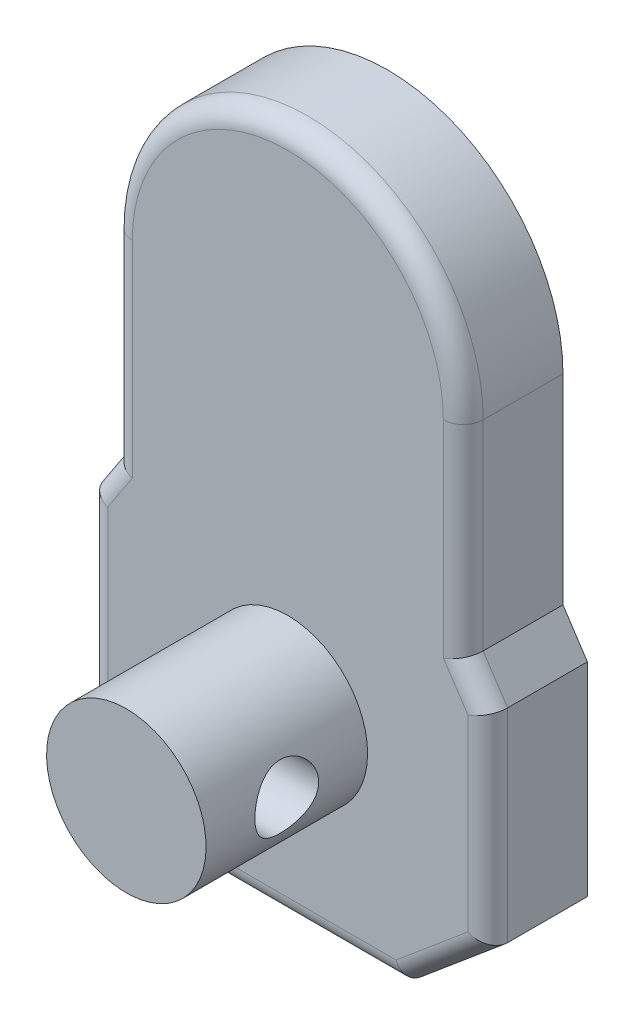
ISO-10303-21;
HEADER;
FILE_DESCRIPTION(('STEP AP214'),'2;1');
FILE_NAME('part.step','',(''),(''),'','','');
FILE_SCHEMA(('AUTOMOTIVE_DESIGN { 1 0 10303 214 1 1 1 1 }'));
ENDSEC;
DATA;
#1=APPLICATION_CONTEXT('core data for automotive mechanical design processes');
#2=APPLICATION_PROTOCOL_DEFINITION('international standard','automotive_design',2000,#1);
#3=PRODUCT_CONTEXT('',#1,'mechanical');
#4=PRODUCT('Part','Part','',(#3));
#5=PRODUCT_RELATED_PRODUCT_CATEGORY('part','',(#4));
#6=PRODUCT_DEFINITION_FORMATION('','',#4);
#7=PRODUCT_DEFINITION_CONTEXT('part definition',#1,'design');
#8=PRODUCT_DEFINITION('design','',#6,#7);
#9=PRODUCT_DEFINITION_SHAPE('','',#8);
#10=(LENGTH_UNIT() NAMED_UNIT(*) SI_UNIT(.MILLI.,.METRE.));
#11=(NAMED_UNIT(*) PLANE_ANGLE_UNIT() SI_UNIT($,.RADIAN.));
#12=(NAMED_UNIT(*) SI_UNIT($,.STERADIAN.) SOLID_ANGLE_UNIT());
#13=UNCERTAINTY_MEASURE_WITH_UNIT(LENGTH_MEASURE(1.E-05),#10,'distance_accuracy_value','');
#14=(GEOMETRIC_REPRESENTATION_CONTEXT(3) GLOBAL_UNCERTAINTY_ASSIGNED_CONTEXT((#13)) GLOBAL_UNIT_ASSIGNED_CONTEXT((#10,
#11,#12)) REPRESENTATION_CONTEXT('',''));
#15=CARTESIAN_POINT('',(0.,0.,0.));
#16=DIRECTION('',(0.,0.,1.));
#17=DIRECTION('',(1.,0.,0.));
#18=AXIS2_PLACEMENT_3D('',#15,#16,#17);
#19=CARTESIAN_POINT('',(0.,32.8,130.3));
#20=DIRECTION('',(0.,0.,1.));
#21=DIRECTION('',(1.,0.,0.));
#22=AXIS2_PLACEMENT_3D('',#19,#20,#21);
#23=PLANE('',#22);
#24=CARTESIAN_POINT('',(-16.,9.,130.3));
#25=DIRECTION('',(0.,0.,1.));
#26=DIRECTION('',(1.,0.,0.));
#27=AXIS2_PLACEMENT_3D('',#24,#25,#26);
#28=CIRCLE('',#27,2.4);
#29=CARTESIAN_POINT('',(-13.6,9.,130.3));
#30=VERTEX_POINT('',#29);
#31=EDGE_CURVE('E678',#30,#30,#28,.T.);
#32=ORIENTED_EDGE('',*,*,#31,.T.);
#33=EDGE_LOOP('',(#32));
#34=FACE_BOUND('',#33,.T.);
#35=CARTESIAN_POINT('',(16.,-9.,130.3));
#36=DIRECTION('',(0.,0.,1.));
#37=DIRECTION('',(1.,0.,0.));
#38=AXIS2_PLACEMENT_3D('',#35,#36,#37);
#39=CIRCLE('',#38,2.4);
#40=CARTESIAN_POINT('',(18.4,-9.,130.3));
#41=VERTEX_POINT('',#40);
#42=EDGE_CURVE('E689',#41,#41,#39,.T.);
#43=ORIENTED_EDGE('',*,*,#42,.T.);
#44=EDGE_LOOP('',(#43));
#45=FACE_BOUND('',#44,.T.);
#46=CARTESIAN_POINT('',(0.,32.8,130.3));
#47=DIRECTION('',(0.,0.,1.));
#48=DIRECTION('',(1.,0.,0.));
#49=AXIS2_PLACEMENT_3D('',#46,#47,#48);
#50=CIRCLE('',#49,17.6);
#51=CARTESIAN_POINT('',(17.6,32.8,130.3));
#52=VERTEX_POINT('',#51);
#53=CARTESIAN_POINT('',(-17.6,32.8,130.3));
#54=VERTEX_POINT('',#53);
#55=EDGE_CURVE('E159',#52,#54,#50,.T.);
#56=ORIENTED_EDGE('',*,*,#55,.F.);
#57=DIRECTION('',(0.,1.,0.));
#58=VECTOR('',#57,1.);
#59=CARTESIAN_POINT('',(17.6,12.7205510344571,130.3));
#60=LINE('',#59,#58);
#61=CARTESIAN_POINT('',(17.6,12.7205510344571,130.3));
#62=VERTEX_POINT('',#61);
#63=EDGE_CURVE('E194',#62,#52,#60,.T.);
#64=ORIENTED_EDGE('',*,*,#63,.F.);
#65=DIRECTION('',(-0.54997194092287,0.835183132131829,0.));
#66=VECTOR('',#65,1.);
#67=CARTESIAN_POINT('',(20.05,9.,130.3));
#68=LINE('',#67,#66);
#69=CARTESIAN_POINT('',(20.05,9.,130.3));
#70=VERTEX_POINT('',#69);
#71=EDGE_CURVE('E191',#70,#62,#68,.T.);
#72=ORIENTED_EDGE('',*,*,#71,.F.);
#73=DIRECTION('',(0.,1.,0.));
#74=VECTOR('',#73,1.);
#75=CARTESIAN_POINT('',(20.05,0.,130.3));
#76=LINE('',#75,#74);
#77=CARTESIAN_POINT('',(20.05,-11.4,130.3));
#78=VERTEX_POINT('',#77);
#79=EDGE_CURVE('E188',#78,#70,#76,.T.);
#80=ORIENTED_EDGE('',*,*,#79,.F.);
#81=DIRECTION('',(0.76604444311898,0.642787609686537,0.));
#82=VECTOR('',#81,1.);
#83=CARTESIAN_POINT('',(20.05,-11.4,130.3));
#84=LINE('',#83,#82);
#85=CARTESIAN_POINT('',(11.5885494925811,-18.5,130.3));
#86=VERTEX_POINT('',#85);
#87=EDGE_CURVE('E185',#86,#78,#84,.T.);
#88=ORIENTED_EDGE('',*,*,#87,.F.);
#89=DIRECTION('',(1.,0.,0.));
#90=VECTOR('',#89,1.);
#91=CARTESIAN_POINT('',(11.5885494925811,-18.5,130.3));
#92=LINE('',#91,#90);
#93=CARTESIAN_POINT('',(-11.5885494925811,-18.5,130.3));
#94=VERTEX_POINT('',#93);
#95=EDGE_CURVE('E182',#94,#86,#92,.T.);
#96=ORIENTED_EDGE('',*,*,#95,.F.);
#97=DIRECTION('',(0.76604444311898,-0.642787609686537,0.));
#98=VECTOR('',#97,1.);
#99=CARTESIAN_POINT('',(-20.05,-11.4,130.3));
#100=LINE('',#99,#98);
#101=CARTESIAN_POINT('',(-20.05,-11.4,130.3));
#102=VERTEX_POINT('',#101);
#103=EDGE_CURVE('E179',#102,#94,#100,.T.);
#104=ORIENTED_EDGE('',*,*,#103,.F.);
#105=DIRECTION('',(0.,-1.,0.));
#106=VECTOR('',#105,1.);
#107=CARTESIAN_POINT('',(-20.05,0.,130.3));
#108=LINE('',#107,#106);
#109=CARTESIAN_POINT('',(-20.05,9.,130.3));
#110=VERTEX_POINT('',#109);
#111=EDGE_CURVE('E173',#110,#102,#108,.T.);
#112=ORIENTED_EDGE('',*,*,#111,.F.);
#113=DIRECTION('',(-0.54997194092287,-0.835183132131829,0.));
#114=VECTOR('',#113,1.);
#115=CARTESIAN_POINT('',(-20.05,9.,130.3));
#116=LINE('',#115,#114);
#117=CARTESIAN_POINT('',(-17.6,12.7205510344571,130.3));
#118=VERTEX_POINT('',#117);
#119=EDGE_CURVE('E171',#118,#110,#116,.T.);
#120=ORIENTED_EDGE('',*,*,#119,.F.);
#121=DIRECTION('',(0.,-1.,0.));
#122=VECTOR('',#121,1.);
#123=CARTESIAN_POINT('',(-17.6,12.7205510344571,130.3));
#124=LINE('',#123,#122);
#125=EDGE_CURVE('E149',#54,#118,#124,.T.);
#126=ORIENTED_EDGE('',*,*,#125,.F.);
#127=EDGE_LOOP('',(#56,#64,#72,#80,#88,#96,#104,#112,#120,#126));
#128=FACE_BOUND('',#127,.T.);
#129=CARTESIAN_POINT('',(-16.,-9.,130.3));
#130=DIRECTION('',(0.,0.,1.));
#131=DIRECTION('',(1.,0.,0.));
#132=AXIS2_PLACEMENT_3D('',#129,#130,#131);
#133=CIRCLE('',#132,2.4);
#134=CARTESIAN_POINT('',(-13.6,-9.,130.3));
#135=VERTEX_POINT('',#134);
#136=EDGE_CURVE('E684',#135,#135,#133,.T.);
#137=ORIENTED_EDGE('',*,*,#136,.T.);
#138=EDGE_LOOP('',(#137));
#139=FACE_BOUND('',#138,.T.);
#140=CARTESIAN_POINT('',(16.,9.,130.3));
#141=DIRECTION('',(0.,0.,1.));
#142=DIRECTION('',(1.,0.,0.));
#143=AXIS2_PLACEMENT_3D('',#140,#141,#142);
#144=CIRCLE('',#143,2.4);
#145=CARTESIAN_POINT('',(18.4,9.,130.3));
#146=VERTEX_POINT('',#145);
#147=EDGE_CURVE('E339',#146,#146,#144,.T.);
#148=ORIENTED_EDGE('',*,*,#147,.T.);
#149=EDGE_LOOP('',(#148));
#150=FACE_BOUND('',#149,.T.);
#151=ADVANCED_FACE('F36',(#34,#45,#128,#139,#150),#23,.F.);
#152=CARTESIAN_POINT('',(0.,32.8,140.3));
#153=DIRECTION('',(0.,0.,-1.));
#154=DIRECTION('',(-1.,0.,0.));
#155=AXIS2_PLACEMENT_3D('',#152,#153,#154);
#156=CYLINDRICAL_SURFACE('',#155,17.6);
#157=DIRECTION('',(0.,0.,-1.));
#158=VECTOR('',#157,1.);
#159=CARTESIAN_POINT('',(-17.6,32.8,140.3));
#160=LINE('',#159,#158);
#161=CARTESIAN_POINT('',(-17.6,32.8,138.3));
#162=VERTEX_POINT('',#161);
#163=EDGE_CURVE('E144',#162,#54,#160,.T.);
#164=ORIENTED_EDGE('',*,*,#163,.F.);
#165=CARTESIAN_POINT('',(0.,32.8,138.3));
#166=DIRECTION('',(0.,0.,1.));
#167=DIRECTION('',(1.,0.,0.));
#168=AXIS2_PLACEMENT_3D('',#165,#166,#167);
#169=CIRCLE('',#168,17.6);
#170=CARTESIAN_POINT('',(17.6,32.8,138.3));
#171=VERTEX_POINT('',#170);
#172=EDGE_CURVE('E11',#162,#171,#169,.F.);
#173=ORIENTED_EDGE('',*,*,#172,.T.);
#174=DIRECTION('',(0.,0.,-1.));
#175=VECTOR('',#174,1.);
#176=CARTESIAN_POINT('',(17.6,32.8,140.3));
#177=LINE('',#176,#175);
#178=EDGE_CURVE('E162',#171,#52,#177,.T.);
#179=ORIENTED_EDGE('',*,*,#178,.T.);
#180=ORIENTED_EDGE('',*,*,#55,.T.);
#181=EDGE_LOOP('',(#164,#173,#179,#180));
#182=FACE_BOUND('',#181,.T.);
#183=ADVANCED_FACE('F160',(#182),#156,.T.);
#184=CARTESIAN_POINT('',(-17.6,12.7205510344571,140.3));
#185=DIRECTION('',(1.,0.,0.));
#186=DIRECTION('',(0.,0.,-1.));
#187=AXIS2_PLACEMENT_3D('',#184,#185,#186);
#188=PLANE('',#187);
#189=DIRECTION('',(0.,0.,-1.));
#190=VECTOR('',#189,1.);
#191=CARTESIAN_POINT('',(-17.6,12.7205510344571,140.3));
#192=LINE('',#191,#190);
#193=CARTESIAN_POINT('',(-17.6,12.7205510344571,138.3));
#194=VERTEX_POINT('',#193);
#195=EDGE_CURVE('E156',#194,#118,#192,.T.);
#196=ORIENTED_EDGE('',*,*,#195,.F.);
#197=DIRECTION('',(0.,-1.,0.));
#198=VECTOR('',#197,1.);
#199=CARTESIAN_POINT('',(-17.6,32.8,138.3));
#200=LINE('',#199,#198);
#201=EDGE_CURVE('E152',#194,#162,#200,.F.);
#202=ORIENTED_EDGE('',*,*,#201,.T.);
#203=ORIENTED_EDGE('',*,*,#163,.T.);
#204=ORIENTED_EDGE('',*,*,#125,.T.);
#205=EDGE_LOOP('',(#196,#202,#203,#204));
#206=FACE_BOUND('',#205,.T.);
#207=ADVANCED_FACE('F147',(#206),#188,.F.);
#208=CARTESIAN_POINT('',(-20.05,9.,140.3));
#209=DIRECTION('',(0.835183132131829,-0.54997194092287,0.));
#210=DIRECTION('',(0.54997194092287,0.835183132131829,0.));
#211=AXIS2_PLACEMENT_3D('',#208,#209,#210);
#212=PLANE('',#211);
#213=DIRECTION('',(0.,0.,-1.));
#214=VECTOR('',#213,1.);
#215=CARTESIAN_POINT('',(-20.05,9.,140.3));
#216=LINE('',#215,#214);
#217=CARTESIAN_POINT('',(-20.05,9.,138.3));
#218=VERTEX_POINT('',#217);
#219=EDGE_CURVE('E209',#218,#110,#216,.T.);
#220=ORIENTED_EDGE('',*,*,#219,.F.);
#221=DIRECTION('',(-0.54997194092287,-0.835183132131829,0.));
#222=VECTOR('',#221,1.);
#223=CARTESIAN_POINT('',(-17.6,12.7205510344571,138.3));
#224=LINE('',#223,#222);
#225=EDGE_CURVE('E377',#218,#194,#224,.F.);
#226=ORIENTED_EDGE('',*,*,#225,.T.);
#227=ORIENTED_EDGE('',*,*,#195,.T.);
#228=ORIENTED_EDGE('',*,*,#119,.T.);
#229=EDGE_LOOP('',(#220,#226,#227,#228));
#230=FACE_BOUND('',#229,.T.);
#231=ADVANCED_FACE('F283',(#230),#212,.F.);
#232=CARTESIAN_POINT('',(-20.05,0.,140.3));
#233=DIRECTION('',(1.,0.,0.));
#234=DIRECTION('',(0.,0.,-1.));
#235=AXIS2_PLACEMENT_3D('',#232,#233,#234);
#236=PLANE('',#235);
#237=DIRECTION('',(0.,0.,-1.));
#238=VECTOR('',#237,1.);
#239=CARTESIAN_POINT('',(-20.05,-11.4,140.3));
#240=LINE('',#239,#238);
#241=CARTESIAN_POINT('',(-20.05,-11.4,138.3));
#242=VERTEX_POINT('',#241);
#243=EDGE_CURVE('E207',#242,#102,#240,.T.);
#244=ORIENTED_EDGE('',*,*,#243,.F.);
#245=DIRECTION('',(0.,-1.,0.));
#246=VECTOR('',#245,1.);
#247=CARTESIAN_POINT('',(-20.05,9.,138.3));
#248=LINE('',#247,#246);
#249=EDGE_CURVE('E371',#242,#218,#248,.F.);
#250=ORIENTED_EDGE('',*,*,#249,.T.);
#251=ORIENTED_EDGE('',*,*,#219,.T.);
#252=ORIENTED_EDGE('',*,*,#111,.T.);
#253=EDGE_LOOP('',(#244,#250,#251,#252));
#254=FACE_BOUND('',#253,.T.);
#255=ADVANCED_FACE('F279',(#254),#236,.F.);
#256=CARTESIAN_POINT('',(-20.05,-11.4,140.3));
#257=DIRECTION('',(0.642787609686537,0.76604444311898,0.));
#258=DIRECTION('',(-0.76604444311898,0.642787609686537,0.));
#259=AXIS2_PLACEMENT_3D('',#256,#257,#258);
#260=PLANE('',#259);
#261=DIRECTION('',(0.,0.,-1.));
#262=VECTOR('',#261,1.);
#263=CARTESIAN_POINT('',(-11.5885494925811,-18.5,140.3));
#264=LINE('',#263,#262);
#265=CARTESIAN_POINT('',(-11.5885494925811,-18.5,138.3));
#266=VERTEX_POINT('',#265);
#267=EDGE_CURVE('E205',#266,#94,#264,.T.);
#268=ORIENTED_EDGE('',*,*,#267,.F.);
#269=DIRECTION('',(0.76604444311898,-0.642787609686537,0.));
#270=VECTOR('',#269,1.);
#271=CARTESIAN_POINT('',(-20.05,-11.4,138.3));
#272=LINE('',#271,#270);
#273=EDGE_CURVE('E375',#266,#242,#272,.F.);
#274=ORIENTED_EDGE('',*,*,#273,.T.);
#275=ORIENTED_EDGE('',*,*,#243,.T.);
#276=ORIENTED_EDGE('',*,*,#103,.T.);
#277=EDGE_LOOP('',(#268,#274,#275,#276));
#278=FACE_BOUND('',#277,.T.);
#279=ADVANCED_FACE('F275',(#278),#260,.F.);
#280=CARTESIAN_POINT('',(11.5885494925811,-18.5,140.3));
#281=DIRECTION('',(0.,1.,0.));
#282=DIRECTION('',(0.,0.,1.));
#283=AXIS2_PLACEMENT_3D('',#280,#281,#282);
#284=PLANE('',#283);
#285=DIRECTION('',(0.,0.,-1.));
#286=VECTOR('',#285,1.);
#287=CARTESIAN_POINT('',(11.5885494925811,-18.5,140.3));
#288=LINE('',#287,#286);
#289=CARTESIAN_POINT('',(11.5885494925811,-18.5,138.3));
#290=VERTEX_POINT('',#289);
#291=EDGE_CURVE('E203',#290,#86,#288,.T.);
#292=ORIENTED_EDGE('',*,*,#291,.F.);
#293=DIRECTION('',(1.,0.,0.));
#294=VECTOR('',#293,1.);
#295=CARTESIAN_POINT('',(-11.5885494925811,-18.5,138.3));
#296=LINE('',#295,#294);
#297=EDGE_CURVE('E334',#290,#266,#296,.F.);
#298=ORIENTED_EDGE('',*,*,#297,.T.);
#299=ORIENTED_EDGE('',*,*,#267,.T.);
#300=ORIENTED_EDGE('',*,*,#95,.T.);
#301=EDGE_LOOP('',(#292,#298,#299,#300));
#302=FACE_BOUND('',#301,.T.);
#303=ADVANCED_FACE('F272',(#302),#284,.F.);
#304=CARTESIAN_POINT('',(20.05,-11.4,140.3));
#305=DIRECTION('',(-0.642787609686537,0.76604444311898,0.));
#306=DIRECTION('',(-0.76604444311898,-0.642787609686537,0.));
#307=AXIS2_PLACEMENT_3D('',#304,#305,#306);
#308=PLANE('',#307);
#309=DIRECTION('',(0.,0.,-1.));
#310=VECTOR('',#309,1.);
#311=CARTESIAN_POINT('',(20.05,-11.4,140.3));
#312=LINE('',#311,#310);
#313=CARTESIAN_POINT('',(20.05,-11.4,138.3));
#314=VERTEX_POINT('',#313);
#315=EDGE_CURVE('E201',#314,#78,#312,.T.);
#316=ORIENTED_EDGE('',*,*,#315,.F.);
#317=DIRECTION('',(0.76604444311898,0.642787609686537,0.));
#318=VECTOR('',#317,1.);
#319=CARTESIAN_POINT('',(11.5885494925811,-18.5,138.3));
#320=LINE('',#319,#318);
#321=EDGE_CURVE('E53',#314,#290,#320,.F.);
#322=ORIENTED_EDGE('',*,*,#321,.T.);
#323=ORIENTED_EDGE('',*,*,#291,.T.);
#324=ORIENTED_EDGE('',*,*,#87,.T.);
#325=EDGE_LOOP('',(#316,#322,#323,#324));
#326=FACE_BOUND('',#325,.T.);
#327=ADVANCED_FACE('F269',(#326),#308,.F.);
#328=CARTESIAN_POINT('',(20.05,0.,140.3));
#329=DIRECTION('',(-1.,0.,0.));
#330=DIRECTION('',(0.,0.,1.));
#331=AXIS2_PLACEMENT_3D('',#328,#329,#330);
#332=PLANE('',#331);
#333=DIRECTION('',(0.,0.,-1.));
#334=VECTOR('',#333,1.);
#335=CARTESIAN_POINT('',(20.05,9.,140.3));
#336=LINE('',#335,#334);
#337=CARTESIAN_POINT('',(20.05,9.,138.3));
#338=VERTEX_POINT('',#337);
#339=EDGE_CURVE('E199',#338,#70,#336,.T.);
#340=ORIENTED_EDGE('',*,*,#339,.F.);
#341=DIRECTION('',(0.,1.,0.));
#342=VECTOR('',#341,1.);
#343=CARTESIAN_POINT('',(20.05,-11.4,138.3));
#344=LINE('',#343,#342);
#345=EDGE_CURVE('E45',#338,#314,#344,.F.);
#346=ORIENTED_EDGE('',*,*,#345,.T.);
#347=ORIENTED_EDGE('',*,*,#315,.T.);
#348=ORIENTED_EDGE('',*,*,#79,.T.);
#349=EDGE_LOOP('',(#340,#346,#347,#348));
#350=FACE_BOUND('',#349,.T.);
#351=ADVANCED_FACE('F265',(#350),#332,.F.);
#352=CARTESIAN_POINT('',(20.05,9.,140.3));
#353=DIRECTION('',(-0.835183132131829,-0.54997194092287,0.));
#354=DIRECTION('',(0.54997194092287,-0.835183132131829,0.));
#355=AXIS2_PLACEMENT_3D('',#352,#353,#354);
#356=PLANE('',#355);
#357=DIRECTION('',(0.,0.,-1.));
#358=VECTOR('',#357,1.);
#359=CARTESIAN_POINT('',(17.6,12.7205510344571,140.3));
#360=LINE('',#359,#358);
#361=CARTESIAN_POINT('',(17.6,12.7205510344571,138.3));
#362=VERTEX_POINT('',#361);
#363=EDGE_CURVE('E197',#362,#62,#360,.T.);
#364=ORIENTED_EDGE('',*,*,#363,.F.);
#365=DIRECTION('',(-0.54997194092287,0.835183132131829,0.));
#366=VECTOR('',#365,1.);
#367=CARTESIAN_POINT('',(20.05,8.99999999999999,138.3));
#368=LINE('',#367,#366);
#369=EDGE_CURVE('E379',#362,#338,#368,.F.);
#370=ORIENTED_EDGE('',*,*,#369,.T.);
#371=ORIENTED_EDGE('',*,*,#339,.T.);
#372=ORIENTED_EDGE('',*,*,#71,.T.);
#373=EDGE_LOOP('',(#364,#370,#371,#372));
#374=FACE_BOUND('',#373,.T.);
#375=ADVANCED_FACE('F261',(#374),#356,.F.);
#376=CARTESIAN_POINT('',(17.6,12.7205510344571,140.3));
#377=DIRECTION('',(-1.,0.,0.));
#378=DIRECTION('',(0.,0.,1.));
#379=AXIS2_PLACEMENT_3D('',#376,#377,#378);
#380=PLANE('',#379);
#381=ORIENTED_EDGE('',*,*,#178,.F.);
#382=DIRECTION('',(0.,1.,0.));
#383=VECTOR('',#382,1.);
#384=CARTESIAN_POINT('',(17.6,12.7205510344571,138.3));
#385=LINE('',#384,#383);
#386=EDGE_CURVE('E382',#171,#362,#385,.F.);
#387=ORIENTED_EDGE('',*,*,#386,.T.);
#388=ORIENTED_EDGE('',*,*,#363,.T.);
#389=ORIENTED_EDGE('',*,*,#63,.T.);
#390=EDGE_LOOP('',(#381,#387,#388,#389));
#391=FACE_BOUND('',#390,.T.);
#392=ADVANCED_FACE('F258',(#391),#380,.F.);
#393=CARTESIAN_POINT('',(0.,32.8,140.3));
#394=DIRECTION('',(0.,0.,1.));
#395=DIRECTION('',(1.,0.,0.));
#396=AXIS2_PLACEMENT_3D('',#393,#394,#395);
#397=PLANE('',#396);
#398=DIRECTION('',(0.76604444311898,-0.642787609686537,0.));
#399=VECTOR('',#398,1.);
#400=CARTESIAN_POINT('',(-10.302974273208,-16.967911113762,140.3));
#401=LINE('',#400,#399);
#402=CARTESIAN_POINT('',(-18.05,-10.46738468369,140.3));
#403=VERTEX_POINT('',#402);
#404=CARTESIAN_POINT('',(-10.8606090240487,-16.5,140.3));
#405=VERTEX_POINT('',#404);
#406=EDGE_CURVE('E386',#403,#405,#401,.T.);
#407=ORIENTED_EDGE('',*,*,#406,.T.);
#408=DIRECTION('',(1.,0.,0.));
#409=VECTOR('',#408,1.);
#410=CARTESIAN_POINT('',(11.5885494925811,-16.5,140.3));
#411=LINE('',#410,#409);
#412=CARTESIAN_POINT('',(10.8606090240487,-16.5,140.3));
#413=VERTEX_POINT('',#412);
#414=EDGE_CURVE('E336',#405,#413,#411,.T.);
#415=ORIENTED_EDGE('',*,*,#414,.T.);
#416=DIRECTION('',(0.76604444311898,0.642787609686537,0.));
#417=VECTOR('',#416,1.);
#418=CARTESIAN_POINT('',(18.7644247806269,-9.86791111376205,140.3));
#419=LINE('',#418,#417);
#420=CARTESIAN_POINT('',(18.05,-10.46738468369,140.3));
#421=VERTEX_POINT('',#420);
#422=EDGE_CURVE('E388',#413,#421,#419,.T.);
#423=ORIENTED_EDGE('',*,*,#422,.T.);
#424=DIRECTION('',(0.,1.,0.));
#425=VECTOR('',#424,1.);
#426=CARTESIAN_POINT('',(18.05,9.,140.3));
#427=LINE('',#426,#425);
#428=CARTESIAN_POINT('',(18.05,8.40063535753621,140.3));
#429=VERTEX_POINT('',#428);
#430=EDGE_CURVE('E392',#421,#429,#427,.T.);
#431=ORIENTED_EDGE('',*,*,#430,.T.);
#432=DIRECTION('',(-0.54997194092287,0.835183132131829,0.));
#433=VECTOR('',#432,1.);
#434=CARTESIAN_POINT('',(15.9296337357363,11.6206071526114,140.3));
#435=LINE('',#434,#433);
#436=CARTESIAN_POINT('',(15.6,12.1211863919933,140.3));
#437=VERTEX_POINT('',#436);
#438=EDGE_CURVE('E394',#429,#437,#435,.T.);
#439=ORIENTED_EDGE('',*,*,#438,.T.);
#440=DIRECTION('',(0.,1.,0.));
#441=VECTOR('',#440,1.);
#442=CARTESIAN_POINT('',(15.6,32.8,140.3));
#443=LINE('',#442,#441);
#444=CARTESIAN_POINT('',(15.6,32.8,140.3));
#445=VERTEX_POINT('',#444);
#446=EDGE_CURVE('E398',#437,#445,#443,.T.);
#447=ORIENTED_EDGE('',*,*,#446,.T.);
#448=CARTESIAN_POINT('',(0.,32.8,140.3));
#449=DIRECTION('',(0.,0.,1.));
#450=DIRECTION('',(1.,0.,0.));
#451=AXIS2_PLACEMENT_3D('',#448,#449,#450);
#452=CIRCLE('',#451,15.6);
#453=CARTESIAN_POINT('',(-15.6,32.8,140.3));
#454=VERTEX_POINT('',#453);
#455=EDGE_CURVE('E214',#445,#454,#452,.T.);
#456=ORIENTED_EDGE('',*,*,#455,.T.);
#457=DIRECTION('',(0.,-1.,0.));
#458=VECTOR('',#457,1.);
#459=CARTESIAN_POINT('',(-15.6,12.7205510344571,140.3));
#460=LINE('',#459,#458);
#461=CARTESIAN_POINT('',(-15.6,12.1211863919934,140.3));
#462=VERTEX_POINT('',#461);
#463=EDGE_CURVE('E401',#454,#462,#460,.T.);
#464=ORIENTED_EDGE('',*,*,#463,.T.);
#465=DIRECTION('',(-0.54997194092287,-0.835183132131829,0.));
#466=VECTOR('',#465,1.);
#467=CARTESIAN_POINT('',(-18.3796337357363,7.90005611815425,140.3));
#468=LINE('',#467,#466);
#469=CARTESIAN_POINT('',(-18.05,8.40063535753622,140.3));
#470=VERTEX_POINT('',#469);
#471=EDGE_CURVE('E396',#462,#470,#468,.T.);
#472=ORIENTED_EDGE('',*,*,#471,.T.);
#473=DIRECTION('',(0.,-1.,0.));
#474=VECTOR('',#473,1.);
#475=CARTESIAN_POINT('',(-18.05,-11.4,140.3));
#476=LINE('',#475,#474);
#477=EDGE_CURVE('E390',#470,#403,#476,.T.);
#478=ORIENTED_EDGE('',*,*,#477,.T.);
#479=EDGE_LOOP('',(#407,#415,#423,#431,#439,#447,#456,#464,#472,#478));
#480=FACE_BOUND('',#479,.T.);
#481=CARTESIAN_POINT('',(0.,0.,140.3));
#482=DIRECTION('',(0.,0.,1.));
#483=DIRECTION('',(1.,0.,0.));
#484=AXIS2_PLACEMENT_3D('',#481,#482,#483);
#485=CIRCLE('',#484,8.);
#486=CARTESIAN_POINT('',(8.,0.,140.3));
#487=VERTEX_POINT('',#486);
#488=EDGE_CURVE('E155',#487,#487,#485,.T.);
#489=ORIENTED_EDGE('',*,*,#488,.F.);
#490=EDGE_LOOP('',(#489));
#491=FACE_BOUND('',#490,.T.);
#492=ADVANCED_FACE('F245',(#480,#491),#397,.T.);
#493=CARTESIAN_POINT('',(0.,0.,-96.6074446622647));
#494=DIRECTION('',(0.,0.,-1.));
#495=DIRECTION('',(0.,1.,0.));
#496=AXIS2_PLACEMENT_3D('',#493,#494,#495);
#497=CYLINDRICAL_SURFACE('',#496,8.);
#498=CARTESIAN_POINT('',(-8.,0.,145.2));
#499=CARTESIAN_POINT('',(-7.99999881568503,-0.0860407476688621,145.200001718376));
#500=CARTESIAN_POINT('',(-7.99860660213407,-0.172111374398289,145.203477210155));
#501=CARTESIAN_POINT('',(-7.99307931921628,-0.343622500823762,145.217336431502));
#502=CARTESIAN_POINT('',(-7.98894251919593,-0.42906256851414,145.227724519957));
#503=CARTESIAN_POINT('',(-7.97252943796007,-0.683836566471975,145.269195882792));
#504=CARTESIAN_POINT('',(-7.95625090417324,-0.851368621356529,145.310585928048));
#505=CARTESIAN_POINT('',(-7.91478889735449,-1.17596836159876,145.419001842998));
#506=CARTESIAN_POINT('',(-7.88963459764986,-1.33306834936618,145.485943785632));
#507=CARTESIAN_POINT('',(-7.83290535705673,-1.63370386566186,145.643230645648));
#508=CARTESIAN_POINT('',(-7.80133264576496,-1.7772440792266,145.733567439217));
#509=CARTESIAN_POINT('',(-7.73329429716655,-2.0536048280824,145.939576806722));
#510=CARTESIAN_POINT('',(-7.69667678265535,-2.18570049923382,146.056170652407));
#511=CARTESIAN_POINT('',(-7.6233691986953,-2.42907914408115,146.309440003139));
#512=CARTESIAN_POINT('',(-7.58667910256982,-2.5403519353811,146.446125274876));
#513=CARTESIAN_POINT('',(-7.51556467783181,-2.74379955420579,146.74308491308));
#514=CARTESIAN_POINT('',(-7.48131385786011,-2.8349040358543,146.904138377823));
#515=CARTESIAN_POINT('',(-7.42133835256894,-2.98840748454932,147.240858237287));
#516=CARTESIAN_POINT('',(-7.39560961929917,-3.05082008558216,147.416517644507));
#517=CARTESIAN_POINT('',(-7.35722172315317,-3.14223813392513,147.769139733796));
#518=CARTESIAN_POINT('',(-7.34402272575215,-3.17263034969284,147.945681976942));
#519=CARTESIAN_POINT('',(-7.33062406472384,-3.20347673422248,148.301815997272));
#520=CARTESIAN_POINT('',(-7.33041800869405,-3.20394562497461,148.481406231369));
#521=CARTESIAN_POINT('',(-7.34256800417352,-3.17598298905449,148.825210674374));
#522=CARTESIAN_POINT('',(-7.35405079937827,-3.14956050312092,148.989625143172));
#523=CARTESIAN_POINT('',(-7.38681900047148,-3.07191500814122,149.311455289721));
#524=CARTESIAN_POINT('',(-7.40810611680668,-3.02068767159904,149.468869741002));
#525=CARTESIAN_POINT('',(-7.45855176176182,-2.89391157217617,149.776028537878));
#526=CARTESIAN_POINT('',(-7.48786206858538,-2.8178877797299,149.925550782478));
#527=CARTESIAN_POINT('',(-7.55100986214542,-2.64401033714619,150.210265306188));
#528=CARTESIAN_POINT('',(-7.58484904728384,-2.54614848815434,150.345452175047));
#529=CARTESIAN_POINT('',(-7.65642778790405,-2.32248095913469,150.60865556608));
#530=CARTESIAN_POINT('',(-7.69426663962585,-2.19509994075507,150.735309967113));
#531=CARTESIAN_POINT('',(-7.76735719932507,-1.9205030838863,150.965895164804));
#532=CARTESIAN_POINT('',(-7.80260839112318,-1.77328330453456,151.069821435857));
#533=CARTESIAN_POINT('',(-7.86743490023482,-1.45932424416993,151.253787915865));
#534=CARTESIAN_POINT('',(-7.89688432152718,-1.29225678615453,151.333315649915));
#535=CARTESIAN_POINT('',(-7.94583725325959,-0.945638024772483,151.462668577725));
#536=CARTESIAN_POINT('',(-7.96534581539797,-0.766093114959462,151.512508860092));
#537=CARTESIAN_POINT('',(-7.9912982321107,-0.411033420172561,151.578317272672));
#538=CARTESIAN_POINT('',(-7.99844713333626,-0.235909270376865,151.596115926806));
#539=CARTESIAN_POINT('',(-8.00109565617006,0.114952495692476,151.602740960846));
#540=CARTESIAN_POINT('',(-7.99659829731666,0.290689941158187,151.591574850476));
#541=CARTESIAN_POINT('',(-7.97692107302005,0.62949238259522,151.541933195917));
#542=CARTESIAN_POINT('',(-7.96223026152835,0.792771986840978,151.504707231439));
#543=CARTESIAN_POINT('',(-7.92415106248801,1.11061668489699,151.405702866704));
#544=CARTESIAN_POINT('',(-7.90076155770456,1.26518065635883,151.34392131253));
#545=CARTESIAN_POINT('',(-7.8466655163329,1.56652605730763,151.195544096512));
#546=CARTESIAN_POINT('',(-7.81575705567654,1.71292483641213,151.108247244732));
#547=CARTESIAN_POINT('',(-7.74997383592869,1.98950974599098,150.91209548175));
#548=CARTESIAN_POINT('',(-7.71509748976546,2.11968934520471,150.80323193132));
#549=CARTESIAN_POINT('',(-7.64232188220856,2.36915686886005,150.558607979285));
#550=CARTESIAN_POINT('',(-7.60437506279614,2.48715829414334,150.421546333608));
#551=CARTESIAN_POINT('',(-7.53186676667879,2.69880191580826,150.128895867167));
#552=CARTESIAN_POINT('',(-7.49730584844168,2.79244009793929,149.97330399939));
#553=CARTESIAN_POINT('',(-7.43542879850565,2.95329200329324,149.645661288716));
#554=CARTESIAN_POINT('',(-7.4081860940903,3.02024095201493,149.473465601511));
#555=CARTESIAN_POINT('',(-7.36517877571315,3.12367395076921,149.118826157005));
#556=CARTESIAN_POINT('',(-7.34940569138321,3.16018048559733,148.936390069764));
#557=CARTESIAN_POINT('',(-7.33234814856936,3.19954499027508,148.58059535803));
#558=CARTESIAN_POINT('',(-7.33010273530302,3.2046353411708,148.407528259786));
#559=CARTESIAN_POINT('',(-7.33783737735716,3.186885045359,148.063128224524));
#560=CARTESIAN_POINT('',(-7.34781588027752,3.16404794535334,147.891795070086));
#561=CARTESIAN_POINT('',(-7.37802638230532,3.09291421975822,147.56266850744));
#562=CARTESIAN_POINT('',(-7.39783729840065,3.0456601139313,147.404607601961));
#563=CARTESIAN_POINT('',(-7.44518403056466,2.92800859333353,147.098594151553));
#564=CARTESIAN_POINT('',(-7.47272197970756,2.85760478708426,146.95064441189));
#565=CARTESIAN_POINT('',(-7.53437771094658,2.69099691007948,146.659824771001));
#566=CARTESIAN_POINT('',(-7.56878195333671,2.59354641209586,146.517730747759));
#567=CARTESIAN_POINT('',(-7.63942103368034,2.3774255144275,146.251210072319));
#568=CARTESIAN_POINT('',(-7.67565642102047,2.25874871890836,146.126788765533));
#569=CARTESIAN_POINT('',(-7.74869642145716,1.99441628177307,145.890877904198));
#570=CARTESIAN_POINT('',(-7.78538562073584,1.84751033003784,145.780749803674));
#571=CARTESIAN_POINT('',(-7.85280901524204,1.53581177091904,145.586651232688));
#572=CARTESIAN_POINT('',(-7.88354043855835,1.37101089311684,145.50269292698));
#573=CARTESIAN_POINT('',(-7.92229149745149,1.11561649378533,145.399388265719));
#574=CARTESIAN_POINT('',(-7.9339120252864,1.02992068514802,145.368900298534));
#575=CARTESIAN_POINT('',(-7.95455598713869,0.855970149541439,145.315266497819));
#576=CARTESIAN_POINT('',(-7.96358063198171,0.767716636804007,145.292117240699));
#577=CARTESIAN_POINT('',(-7.97874713067035,0.589554726269187,145.253459166972));
#578=CARTESIAN_POINT('',(-7.98489629235546,0.499651133731158,145.23793097692));
#579=CARTESIAN_POINT('',(-7.99416010033403,0.318735582870626,145.214609437022));
#580=CARTESIAN_POINT('',(-7.99727690339628,0.227724458999158,145.206810589599));
#581=CARTESIAN_POINT('',(-7.99961162902246,0.091064538865681,145.200971178234));
#582=CARTESIAN_POINT('',(-8.00000062679027,0.0455364539659345,145.199999090562));
#583=CARTESIAN_POINT('',(-8.,0.,145.2));
#584=B_SPLINE_CURVE_WITH_KNOTS('',3,(#498,#499,#500,#501,#502,#503,#504,#505,#506,#507,#508,
#509,#510,#511,#512,#513,#514,#515,#516,#517,#518,#519,#520,#521,#522,#523,#524,#525,#526,#527,
#528,#529,#530,#531,#532,#533,#534,#535,#536,#537,#538,#539,#540,#541,#542,#543,#544,#545,#546,
#547,#548,#549,#550,#551,#552,#553,#554,#555,#556,#557,#558,#559,#560,#561,#562,#563,#564,#565,
#566,#567,#568,#569,#570,#571,#572,#573,#574,#575,#576,#577,#578,#579,#580,#581,#582,#583),
.UNSPECIFIED.,.T.,.F.,(4,2,2,2,2,2,2,2,2,2,2,2,2,2,2,2,2,2,2,2,2,2,2,2,2,2,2,2,2,2,2,2,2,2,2,2,
2,2,2,2,2,2,4),(0.,0.258083194737726,0.516329283829188,1.03357832081297,1.54914283515482,
2.06452856028803,2.60204261040665,3.13981882215088,3.70152864430775,4.26297127309256,
4.79895018814157,5.33466540464811,5.83309775765887,6.3316170993664,6.8403105240507,
7.34919525428059,7.89741809025457,8.44574998870537,9.00491511387456,9.5637958010903,
10.0895914557178,10.615250800391,11.1172917922995,11.6193972871704,12.1368607176419,
12.6545318552532,13.2063800972603,13.7583192079696,14.3156052255229,14.8724792656046,
15.3892792775537,15.9060136642784,16.40231360005,16.8987506761523,17.4236119921767,
17.948631724844,18.507691279811,19.0670103215182,19.3418005700401,19.6164624365708,
19.8904224237509,20.1641874137937,20.300776109673),.UNSPECIFIED.);
#585=CARTESIAN_POINT('',(-8.,0.,145.2));
#586=VERTEX_POINT('',#585);
#587=EDGE_CURVE('E222',#586,#586,#584,.T.);
#588=ORIENTED_EDGE('',*,*,#587,.F.);
#589=EDGE_LOOP('',(#588));
#590=FACE_BOUND('',#589,.T.);
#591=CARTESIAN_POINT('',(8.,0.,145.2));
#592=CARTESIAN_POINT('',(7.99999881568503,0.086040747668816,145.200001718376));
#593=CARTESIAN_POINT('',(7.99860660213407,0.172111374398243,145.203477210155));
#594=CARTESIAN_POINT('',(7.99307931921628,0.343622500823716,145.217336431502));
#595=CARTESIAN_POINT('',(7.98894251919593,0.429062568514094,145.227724519957));
#596=CARTESIAN_POINT('',(7.97252943796007,0.683836566471929,145.269195882792));
#597=CARTESIAN_POINT('',(7.95625090417324,0.851368621356483,145.310585928048));
#598=CARTESIAN_POINT('',(7.91478889735449,1.17596836159871,145.419001842998));
#599=CARTESIAN_POINT('',(7.88963459764986,1.33306834936613,145.485943785632));
#600=CARTESIAN_POINT('',(7.83290535705673,1.63370386566182,145.643230645648));
#601=CARTESIAN_POINT('',(7.80133264576496,1.77724407922656,145.733567439217));
#602=CARTESIAN_POINT('',(7.73329429716655,2.05360482808236,145.939576806722));
#603=CARTESIAN_POINT('',(7.69667678265535,2.18570049923378,146.056170652407));
#604=CARTESIAN_POINT('',(7.6233691986953,2.4290791440811,146.309440003139));
#605=CARTESIAN_POINT('',(7.58667910256982,2.54035193538106,146.446125274876));
#606=CARTESIAN_POINT('',(7.51556467783181,2.74379955420575,146.74308491308));
#607=CARTESIAN_POINT('',(7.48131385786011,2.83490403585425,146.904138377823));
#608=CARTESIAN_POINT('',(7.42133835256894,2.98840748454927,147.240858237287));
#609=CARTESIAN_POINT('',(7.39560961929917,3.05082008558211,147.416517644507));
#610=CARTESIAN_POINT('',(7.35722172315317,3.14223813392509,147.769139733796));
#611=CARTESIAN_POINT('',(7.34402272575215,3.17263034969279,147.945681976942));
#612=CARTESIAN_POINT('',(7.33062406472384,3.20347673422243,148.301815997272));
#613=CARTESIAN_POINT('',(7.33041800869405,3.20394562497456,148.481406231369));
#614=CARTESIAN_POINT('',(7.34256800417351,3.17598298905444,148.825210674374));
#615=CARTESIAN_POINT('',(7.35405079937827,3.14956050312087,148.989625143172));
#616=CARTESIAN_POINT('',(7.38681900047148,3.07191500814118,149.311455289721));
#617=CARTESIAN_POINT('',(7.40810611680668,3.02068767159899,149.468869741002));
#618=CARTESIAN_POINT('',(7.45855176176182,2.89391157217612,149.776028537878));
#619=CARTESIAN_POINT('',(7.48786206858538,2.81788777972986,149.925550782478));
#620=CARTESIAN_POINT('',(7.55100986214542,2.64401033714614,150.210265306188));
#621=CARTESIAN_POINT('',(7.58484904728384,2.54614848815429,150.345452175047));
#622=CARTESIAN_POINT('',(7.65642778790404,2.32248095913465,150.60865556608));
#623=CARTESIAN_POINT('',(7.69426663962586,2.19509994075502,150.735309967113));
#624=CARTESIAN_POINT('',(7.76735719932508,1.92050308388625,150.965895164804));
#625=CARTESIAN_POINT('',(7.80260839112318,1.77328330453452,151.069821435857));
#626=CARTESIAN_POINT('',(7.86743490023482,1.45932424416988,151.253787915865));
#627=CARTESIAN_POINT('',(7.89688432152718,1.29225678615449,151.333315649915));
#628=CARTESIAN_POINT('',(7.94583725325959,0.945638024772437,151.462668577725));
#629=CARTESIAN_POINT('',(7.96534581539797,0.766093114959416,151.512508860092));
#630=CARTESIAN_POINT('',(7.9912982321107,0.411033420172515,151.578317272672));
#631=CARTESIAN_POINT('',(7.99844713333626,0.23590927037682,151.596115926806));
#632=CARTESIAN_POINT('',(8.00109565617006,-0.114952495692522,151.602740960846));
#633=CARTESIAN_POINT('',(7.99659829731666,-0.290689941158233,151.591574850476));
#634=CARTESIAN_POINT('',(7.97692107302005,-0.629492382595265,151.541933195917));
#635=CARTESIAN_POINT('',(7.96223026152835,-0.792771986841024,151.504707231439));
#636=CARTESIAN_POINT('',(7.92415106248801,-1.11061668489703,151.405702866704));
#637=CARTESIAN_POINT('',(7.90076155770456,-1.26518065635888,151.34392131253));
#638=CARTESIAN_POINT('',(7.8466655163329,-1.56652605730767,151.195544096512));
#639=CARTESIAN_POINT('',(7.81575705567655,-1.71292483641218,151.108247244732));
#640=CARTESIAN_POINT('',(7.74997383592869,-1.98950974599102,150.91209548175));
#641=CARTESIAN_POINT('',(7.71509748976546,-2.11968934520475,150.80323193132));
#642=CARTESIAN_POINT('',(7.64232188220857,-2.36915686886009,150.558607979285));
#643=CARTESIAN_POINT('',(7.60437506279614,-2.48715829414338,150.421546333608));
#644=CARTESIAN_POINT('',(7.53186676667879,-2.69880191580831,150.128895867167));
#645=CARTESIAN_POINT('',(7.49730584844168,-2.79244009793934,149.97330399939));
#646=CARTESIAN_POINT('',(7.43542879850565,-2.95329200329328,149.645661288716));
#647=CARTESIAN_POINT('',(7.4081860940903,-3.02024095201497,149.473465601511));
#648=CARTESIAN_POINT('',(7.36517877571314,-3.12367395076926,149.118826157005));
#649=CARTESIAN_POINT('',(7.34940569138321,-3.16018048559737,148.936390069764));
#650=CARTESIAN_POINT('',(7.33234814856936,-3.19954499027513,148.58059535803));
#651=CARTESIAN_POINT('',(7.33010273530302,-3.20463534117085,148.407528259786));
#652=CARTESIAN_POINT('',(7.33783737735717,-3.18688504535905,148.063128224524));
#653=CARTESIAN_POINT('',(7.34781588027752,-3.16404794535339,147.891795070086));
#654=CARTESIAN_POINT('',(7.37802638230532,-3.09291421975826,147.56266850744));
#655=CARTESIAN_POINT('',(7.39783729840065,-3.04566011393134,147.404607601961));
#656=CARTESIAN_POINT('',(7.44518403056466,-2.92800859333358,147.098594151553));
#657=CARTESIAN_POINT('',(7.47272197970756,-2.8576047870843,146.95064441189));
#658=CARTESIAN_POINT('',(7.53437771094658,-2.69099691007953,146.659824771001));
#659=CARTESIAN_POINT('',(7.56878195333671,-2.5935464120959,146.517730747759));
#660=CARTESIAN_POINT('',(7.63942103368034,-2.37742551442755,146.251210072319));
#661=CARTESIAN_POINT('',(7.67565642102047,-2.2587487189084,146.126788765533));
#662=CARTESIAN_POINT('',(7.74869642145716,-1.99441628177311,145.890877904198));
#663=CARTESIAN_POINT('',(7.78538562073584,-1.84751033003789,145.780749803674));
#664=CARTESIAN_POINT('',(7.85280901524204,-1.53581177091908,145.586651232688));
#665=CARTESIAN_POINT('',(7.88354043855835,-1.37101089311689,145.50269292698));
#666=CARTESIAN_POINT('',(7.92229149745149,-1.11561649378538,145.399388265719));
#667=CARTESIAN_POINT('',(7.9339120252864,-1.02992068514806,145.368900298534));
#668=CARTESIAN_POINT('',(7.95455598713869,-0.855970149541474,145.315266497819));
#669=CARTESIAN_POINT('',(7.96358063198171,-0.767716636804044,145.292117240699));
#670=CARTESIAN_POINT('',(7.97874713067035,-0.589554726269226,145.253459166972));
#671=CARTESIAN_POINT('',(7.98489629235547,-0.499651133731199,145.23793097692));
#672=CARTESIAN_POINT('',(7.99416010033403,-0.318735582870669,145.214609437022));
#673=CARTESIAN_POINT('',(7.99727690339628,-0.227724458999203,145.206810589599));
#674=CARTESIAN_POINT('',(7.99961162902246,-0.0910645388657271,145.200971178234));
#675=CARTESIAN_POINT('',(8.00000062679027,-0.0455364539659806,145.199999090562));
#676=CARTESIAN_POINT('',(8.,0.,145.2));
#677=B_SPLINE_CURVE_WITH_KNOTS('',3,(#591,#592,#593,#594,#595,#596,#597,#598,#599,#600,#601,
#602,#603,#604,#605,#606,#607,#608,#609,#610,#611,#612,#613,#614,#615,#616,#617,#618,#619,#620,
#621,#622,#623,#624,#625,#626,#627,#628,#629,#630,#631,#632,#633,#634,#635,#636,#637,#638,#639,
#640,#641,#642,#643,#644,#645,#646,#647,#648,#649,#650,#651,#652,#653,#654,#655,#656,#657,#658,
#659,#660,#661,#662,#663,#664,#665,#666,#667,#668,#669,#670,#671,#672,#673,#674,#675,#676),
.UNSPECIFIED.,.T.,.F.,(4,2,2,2,2,2,2,2,2,2,2,2,2,2,2,2,2,2,2,2,2,2,2,2,2,2,2,2,2,2,2,2,2,2,2,2,
2,2,2,2,2,2,4),(0.,0.258083194737726,0.516329283829188,1.03357832081297,1.54914283515482,
2.06452856028803,2.60204261040665,3.13981882215088,3.70152864430775,4.26297127309256,
4.79895018814157,5.33466540464811,5.83309775765887,6.3316170993664,6.8403105240507,
7.34919525428059,7.89741809025457,8.44574998870537,9.00491511387456,9.5637958010903,
10.0895914557178,10.615250800391,11.1172917922995,11.6193972871704,12.1368607176419,
12.6545318552532,13.2063800972603,13.7583192079696,14.3156052255229,14.8724792656046,
15.3892792775537,15.9060136642784,16.40231360005,16.8987506761523,17.4236119921767,
17.948631724844,18.507691279811,19.0670103215182,19.3418005700401,19.6164624365709,
19.8904224237509,20.1641874137937,20.300776109673),.UNSPECIFIED.);
#678=CARTESIAN_POINT('',(8.,0.,145.2));
#679=VERTEX_POINT('',#678);
#680=EDGE_CURVE('E215',#679,#679,#677,.T.);
#681=ORIENTED_EDGE('',*,*,#680,.F.);
#682=EDGE_LOOP('',(#681));
#683=FACE_BOUND('',#682,.T.);
#684=CARTESIAN_POINT('',(0.,0.,156.5));
#685=DIRECTION('',(0.,0.,-1.));
#686=DIRECTION('',(0.,1.,0.));
#687=AXIS2_PLACEMENT_3D('',#684,#685,#686);
#688=CIRCLE('',#687,8.);
#689=CARTESIAN_POINT('',(0.,7.99999999999997,156.5));
#690=VERTEX_POINT('',#689);
#691=EDGE_CURVE('E166',#690,#690,#688,.T.);
#692=ORIENTED_EDGE('',*,*,#691,.T.);
#693=EDGE_LOOP('',(#692));
#694=FACE_BOUND('',#693,.T.);
#695=ORIENTED_EDGE('',*,*,#488,.T.);
#696=EDGE_LOOP('',(#695));
#697=FACE_BOUND('',#696,.T.);
#698=ADVANCED_FACE('F227',(#590,#683,#694,#697),#497,.T.);
#699=CARTESIAN_POINT('',(0.,7.99999999999997,156.5));
#700=DIRECTION('',(0.,0.,1.));
#701=DIRECTION('',(0.,-1.,0.));
#702=AXIS2_PLACEMENT_3D('',#699,#700,#701);
#703=PLANE('',#702);
#704=ORIENTED_EDGE('',*,*,#691,.F.);
#705=EDGE_LOOP('',(#704));
#706=FACE_BOUND('',#705,.T.);
#707=ADVANCED_FACE('F236',(#706),#703,.T.);
#708=CARTESIAN_POINT('',(-20.05,0.,148.4));
#709=DIRECTION('',(1.,0.,0.));
#710=DIRECTION('',(0.,0.,-1.));
#711=AXIS2_PLACEMENT_3D('',#708,#709,#710);
#712=CYLINDRICAL_SURFACE('',#711,3.20000000000001);
#713=ORIENTED_EDGE('',*,*,#587,.T.);
#714=EDGE_LOOP('',(#713));
#715=FACE_BOUND('',#714,.T.);
#716=ORIENTED_EDGE('',*,*,#680,.T.);
#717=EDGE_LOOP('',(#716));
#718=FACE_BOUND('',#717,.T.);
#719=ADVANCED_FACE('F231',(#715,#718),#712,.F.);
#720=CARTESIAN_POINT('',(16.,-9.,138.8));
#721=DIRECTION('',(0.,0.,-1.));
#722=DIRECTION('',(-1.,0.,0.));
#723=AXIS2_PLACEMENT_3D('',#720,#721,#722);
#724=CYLINDRICAL_SURFACE('',#723,2.4);
#725=CARTESIAN_POINT('',(16.,-9.,138.8));
#726=DIRECTION('',(0.,0.,1.));
#727=DIRECTION('',(1.,0.,0.));
#728=AXIS2_PLACEMENT_3D('',#725,#726,#727);
#729=CIRCLE('',#728,2.4);
#730=CARTESIAN_POINT('',(18.4,-9.,138.8));
#731=VERTEX_POINT('',#730);
#732=EDGE_CURVE('E223',#731,#731,#729,.T.);
#733=ORIENTED_EDGE('',*,*,#732,.T.);
#734=EDGE_LOOP('',(#733));
#735=FACE_BOUND('',#734,.T.);
#736=ORIENTED_EDGE('',*,*,#42,.F.);
#737=EDGE_LOOP('',(#736));
#738=FACE_BOUND('',#737,.T.);
#739=ADVANCED_FACE('F235',(#735,#738),#724,.F.);
#740=CARTESIAN_POINT('',(16.,-9.,138.8));
#741=DIRECTION('',(0.,0.,1.));
#742=DIRECTION('',(1.,0.,0.));
#743=AXIS2_PLACEMENT_3D('',#740,#741,#742);
#744=PLANE('',#743);
#745=ORIENTED_EDGE('',*,*,#732,.F.);
#746=EDGE_LOOP('',(#745));
#747=FACE_BOUND('',#746,.T.);
#748=ADVANCED_FACE('F463',(#747),#744,.F.);
#749=CARTESIAN_POINT('',(-16.,-9.,138.8));
#750=DIRECTION('',(0.,0.,-1.));
#751=DIRECTION('',(-1.,0.,0.));
#752=AXIS2_PLACEMENT_3D('',#749,#750,#751);
#753=CYLINDRICAL_SURFACE('',#752,2.4);
#754=CARTESIAN_POINT('',(-16.,-9.,138.8));
#755=DIRECTION('',(0.,0.,1.));
#756=DIRECTION('',(1.,0.,0.));
#757=AXIS2_PLACEMENT_3D('',#754,#755,#756);
#758=CIRCLE('',#757,2.4);
#759=CARTESIAN_POINT('',(-13.6,-9.,138.8));
#760=VERTEX_POINT('',#759);
#761=EDGE_CURVE('E686',#760,#760,#758,.T.);
#762=ORIENTED_EDGE('',*,*,#761,.T.);
#763=EDGE_LOOP('',(#762));
#764=FACE_BOUND('',#763,.T.);
#765=ORIENTED_EDGE('',*,*,#136,.F.);
#766=EDGE_LOOP('',(#765));
#767=FACE_BOUND('',#766,.T.);
#768=ADVANCED_FACE('F472',(#764,#767),#753,.F.);
#769=CARTESIAN_POINT('',(-16.,-9.,138.8));
#770=DIRECTION('',(0.,0.,1.));
#771=DIRECTION('',(1.,0.,0.));
#772=AXIS2_PLACEMENT_3D('',#769,#770,#771);
#773=PLANE('',#772);
#774=ORIENTED_EDGE('',*,*,#761,.F.);
#775=EDGE_LOOP('',(#774));
#776=FACE_BOUND('',#775,.T.);
#777=ADVANCED_FACE('F481',(#776),#773,.F.);
#778=CARTESIAN_POINT('',(-16.,9.,138.8));
#779=DIRECTION('',(0.,0.,-1.));
#780=DIRECTION('',(-1.,0.,0.));
#781=AXIS2_PLACEMENT_3D('',#778,#779,#780);
#782=CYLINDRICAL_SURFACE('',#781,2.4);
#783=CARTESIAN_POINT('',(-16.,9.,138.8));
#784=DIRECTION('',(0.,0.,1.));
#785=DIRECTION('',(1.,0.,0.));
#786=AXIS2_PLACEMENT_3D('',#783,#784,#785);
#787=CIRCLE('',#786,2.4);
#788=CARTESIAN_POINT('',(-13.6,9.,138.8));
#789=VERTEX_POINT('',#788);
#790=EDGE_CURVE('E680',#789,#789,#787,.T.);
#791=ORIENTED_EDGE('',*,*,#790,.T.);
#792=EDGE_LOOP('',(#791));
#793=FACE_BOUND('',#792,.T.);
#794=ORIENTED_EDGE('',*,*,#31,.F.);
#795=EDGE_LOOP('',(#794));
#796=FACE_BOUND('',#795,.T.);
#797=ADVANCED_FACE('F491',(#793,#796),#782,.F.);
#798=CARTESIAN_POINT('',(-16.,9.,138.8));
#799=DIRECTION('',(0.,0.,1.));
#800=DIRECTION('',(1.,0.,0.));
#801=AXIS2_PLACEMENT_3D('',#798,#799,#800);
#802=PLANE('',#801);
#803=ORIENTED_EDGE('',*,*,#790,.F.);
#804=EDGE_LOOP('',(#803));
#805=FACE_BOUND('',#804,.T.);
#806=ADVANCED_FACE('F501',(#805),#802,.F.);
#807=CARTESIAN_POINT('',(16.,9.,138.8));
#808=DIRECTION('',(0.,0.,-1.));
#809=DIRECTION('',(-1.,0.,0.));
#810=AXIS2_PLACEMENT_3D('',#807,#808,#809);
#811=CYLINDRICAL_SURFACE('',#810,2.4);
#812=CARTESIAN_POINT('',(16.,9.,138.8));
#813=DIRECTION('',(0.,0.,1.));
#814=DIRECTION('',(1.,0.,0.));
#815=AXIS2_PLACEMENT_3D('',#812,#813,#814);
#816=CIRCLE('',#815,2.4);
#817=CARTESIAN_POINT('',(18.4,9.,138.8));
#818=VERTEX_POINT('',#817);
#819=EDGE_CURVE('E342',#818,#818,#816,.T.);
#820=ORIENTED_EDGE('',*,*,#819,.T.);
#821=EDGE_LOOP('',(#820));
#822=FACE_BOUND('',#821,.T.);
#823=ORIENTED_EDGE('',*,*,#147,.F.);
#824=EDGE_LOOP('',(#823));
#825=FACE_BOUND('',#824,.T.);
#826=ADVANCED_FACE('F511',(#822,#825),#811,.F.);
#827=CARTESIAN_POINT('',(16.,9.,138.8));
#828=DIRECTION('',(0.,0.,1.));
#829=DIRECTION('',(1.,0.,0.));
#830=AXIS2_PLACEMENT_3D('',#827,#828,#829);
#831=PLANE('',#830);
#832=ORIENTED_EDGE('',*,*,#819,.F.);
#833=EDGE_LOOP('',(#832));
#834=FACE_BOUND('',#833,.T.);
#835=ADVANCED_FACE('F327',(#834),#831,.F.);
#836=CARTESIAN_POINT('',(-28.7628531410857,-1.47823356414871,138.3));
#837=DIRECTION('',(-0.76604444311898,0.642787609686537,0.));
#838=DIRECTION('',(-0.642787609686537,-0.76604444311898,0.));
#839=AXIS2_PLACEMENT_3D('',#836,#837,#838);
#840=CYLINDRICAL_SURFACE('',#839,2.);
#841=CARTESIAN_POINT('',(-18.05,-10.46738468369,138.3));
#842=DIRECTION('',(-0.422618261740701,0.906307787036649,0.));
#843=DIRECTION('',(0.906307787036649,0.422618261740701,0.));
#844=AXIS2_PLACEMENT_3D('',#841,#842,#843);
#845=ELLIPSE('',#844,2.20675583792498,2.);
#846=EDGE_CURVE('E340',#242,#403,#845,.T.);
#847=ORIENTED_EDGE('',*,*,#846,.F.);
#848=ORIENTED_EDGE('',*,*,#273,.F.);
#849=CARTESIAN_POINT('',(-10.8606090240486,-16.5,138.3));
#850=DIRECTION('',(-0.939692620785909,0.342020143325667,0.));
#851=DIRECTION('',(-0.342020143325667,-0.939692620785909,0.));
#852=AXIS2_PLACEMENT_3D('',#849,#850,#851);
#853=ELLIPSE('',#852,2.12835554495182,2.);
#854=EDGE_CURVE('E40',#405,#266,#853,.F.);
#855=ORIENTED_EDGE('',*,*,#854,.F.);
#856=ORIENTED_EDGE('',*,*,#406,.F.);
#857=EDGE_LOOP('',(#847,#848,#855,#856));
#858=FACE_BOUND('',#857,.T.);
#859=ADVANCED_FACE('F38',(#858),#840,.T.);
#860=CARTESIAN_POINT('',(0.,-16.5,138.3));
#861=DIRECTION('',(-1.,0.,0.));
#862=DIRECTION('',(0.,0.,1.));
#863=AXIS2_PLACEMENT_3D('',#860,#861,#862);
#864=CYLINDRICAL_SURFACE('',#863,2.);
#865=ORIENTED_EDGE('',*,*,#854,.T.);
#866=ORIENTED_EDGE('',*,*,#297,.F.);
#867=CARTESIAN_POINT('',(10.8606090240486,-16.5,138.3));
#868=DIRECTION('',(-0.939692620785909,-0.342020143325667,0.));
#869=DIRECTION('',(-0.342020143325667,0.939692620785909,0.));
#870=AXIS2_PLACEMENT_3D('',#867,#868,#869);
#871=ELLIPSE('',#870,2.12835554495182,2.);
#872=EDGE_CURVE('E345',#413,#290,#871,.F.);
#873=ORIENTED_EDGE('',*,*,#872,.F.);
#874=ORIENTED_EDGE('',*,*,#414,.F.);
#875=EDGE_LOOP('',(#865,#866,#873,#874));
#876=FACE_BOUND('',#875,.T.);
#877=ADVANCED_FACE('F320',(#876),#864,.T.);
#878=CARTESIAN_POINT('',(-18.05,32.8,138.3));
#879=DIRECTION('',(0.,1.,0.));
#880=DIRECTION('',(0.,0.,1.));
#881=AXIS2_PLACEMENT_3D('',#878,#879,#880);
#882=CYLINDRICAL_SURFACE('',#881,2.);
#883=ORIENTED_EDGE('',*,*,#846,.T.);
#884=ORIENTED_EDGE('',*,*,#477,.F.);
#885=CARTESIAN_POINT('',(-18.05,8.40063535753622,138.3));
#886=DIRECTION('',(0.287068692013054,0.957909998938269,0.));
#887=DIRECTION('',(-0.957909998938269,0.287068692013054,0.));
#888=AXIS2_PLACEMENT_3D('',#885,#886,#887);
#889=ELLIPSE('',#888,2.08787882182748,2.);
#890=EDGE_CURVE('E349',#218,#470,#889,.T.);
#891=ORIENTED_EDGE('',*,*,#890,.F.);
#892=ORIENTED_EDGE('',*,*,#249,.F.);
#893=EDGE_LOOP('',(#883,#884,#891,#892));
#894=FACE_BOUND('',#893,.T.);
#895=ADVANCED_FACE('F317',(#894),#882,.T.);
#896=CARTESIAN_POINT('',(28.7628531410857,-1.47823356414871,138.3));
#897=DIRECTION('',(-0.76604444311898,-0.642787609686537,0.));
#898=DIRECTION('',(0.642787609686537,-0.76604444311898,0.));
#899=AXIS2_PLACEMENT_3D('',#896,#897,#898);
#900=CYLINDRICAL_SURFACE('',#899,2.);
#901=ORIENTED_EDGE('',*,*,#872,.T.);
#902=ORIENTED_EDGE('',*,*,#321,.F.);
#903=CARTESIAN_POINT('',(18.05,-10.46738468369,138.3));
#904=DIRECTION('',(-0.422618261740701,-0.906307787036649,0.));
#905=DIRECTION('',(0.906307787036649,-0.422618261740701,0.));
#906=AXIS2_PLACEMENT_3D('',#903,#904,#905);
#907=ELLIPSE('',#906,2.20675583792498,2.);
#908=EDGE_CURVE('E354',#421,#314,#907,.F.);
#909=ORIENTED_EDGE('',*,*,#908,.F.);
#910=ORIENTED_EDGE('',*,*,#422,.F.);
#911=EDGE_LOOP('',(#901,#902,#909,#910));
#912=FACE_BOUND('',#911,.T.);
#913=ADVANCED_FACE('F313',(#912),#900,.T.);
#914=CARTESIAN_POINT('',(-1.38313810362777,33.7108028145574,138.3));
#915=DIRECTION('',(0.54997194092287,0.835183132131829,0.));
#916=DIRECTION('',(-0.835183132131829,0.54997194092287,0.));
#917=AXIS2_PLACEMENT_3D('',#914,#915,#916);
#918=CYLINDRICAL_SURFACE('',#917,2.);
#919=ORIENTED_EDGE('',*,*,#890,.T.);
#920=ORIENTED_EDGE('',*,*,#471,.F.);
#921=CARTESIAN_POINT('',(-15.6,12.1211863919933,138.3));
#922=DIRECTION('',(0.287068692013054,0.957909998938269,0.));
#923=DIRECTION('',(-0.957909998938269,0.287068692013054,0.));
#924=AXIS2_PLACEMENT_3D('',#921,#922,#923);
#925=ELLIPSE('',#924,2.08787882182748,2.);
#926=EDGE_CURVE('E357',#194,#462,#925,.T.);
#927=ORIENTED_EDGE('',*,*,#926,.F.);
#928=ORIENTED_EDGE('',*,*,#225,.F.);
#929=EDGE_LOOP('',(#919,#920,#927,#928));
#930=FACE_BOUND('',#929,.T.);
#931=ADVANCED_FACE('F309',(#930),#918,.T.);
#932=CARTESIAN_POINT('',(18.05,32.8,138.3));
#933=DIRECTION('',(0.,-1.,0.));
#934=DIRECTION('',(0.,0.,-1.));
#935=AXIS2_PLACEMENT_3D('',#932,#933,#934);
#936=CYLINDRICAL_SURFACE('',#935,2.);
#937=ORIENTED_EDGE('',*,*,#908,.T.);
#938=ORIENTED_EDGE('',*,*,#345,.F.);
#939=CARTESIAN_POINT('',(18.05,8.40063535753622,138.3));
#940=DIRECTION('',(0.287068692013054,-0.957909998938269,0.));
#941=DIRECTION('',(-0.957909998938269,-0.287068692013054,0.));
#942=AXIS2_PLACEMENT_3D('',#939,#940,#941);
#943=ELLIPSE('',#942,2.08787882182748,2.);
#944=EDGE_CURVE('E360',#429,#338,#943,.F.);
#945=ORIENTED_EDGE('',*,*,#944,.F.);
#946=ORIENTED_EDGE('',*,*,#430,.F.);
#947=EDGE_LOOP('',(#937,#938,#945,#946));
#948=FACE_BOUND('',#947,.T.);
#949=ADVANCED_FACE('F305',(#948),#936,.T.);
#950=CARTESIAN_POINT('',(-15.6,32.8,138.3));
#951=DIRECTION('',(0.,1.,0.));
#952=DIRECTION('',(0.,0.,1.));
#953=AXIS2_PLACEMENT_3D('',#950,#951,#952);
#954=CYLINDRICAL_SURFACE('',#953,2.);
#955=ORIENTED_EDGE('',*,*,#926,.T.);
#956=ORIENTED_EDGE('',*,*,#463,.F.);
#957=CARTESIAN_POINT('',(-15.6,32.8,138.3));
#958=DIRECTION('',(0.,1.,0.));
#959=DIRECTION('',(0.,0.,1.));
#960=AXIS2_PLACEMENT_3D('',#957,#958,#959);
#961=CIRCLE('',#960,2.);
#962=EDGE_CURVE('E363',#162,#454,#961,.T.);
#963=ORIENTED_EDGE('',*,*,#962,.F.);
#964=ORIENTED_EDGE('',*,*,#201,.F.);
#965=EDGE_LOOP('',(#955,#956,#963,#964));
#966=FACE_BOUND('',#965,.T.);
#967=ADVANCED_FACE('F301',(#966),#954,.T.);
#968=CARTESIAN_POINT('',(1.38313810362777,33.7108028145574,138.3));
#969=DIRECTION('',(0.54997194092287,-0.835183132131829,0.));
#970=DIRECTION('',(0.835183132131829,0.54997194092287,0.));
#971=AXIS2_PLACEMENT_3D('',#968,#969,#970);
#972=CYLINDRICAL_SURFACE('',#971,2.);
#973=ORIENTED_EDGE('',*,*,#944,.T.);
#974=ORIENTED_EDGE('',*,*,#369,.F.);
#975=CARTESIAN_POINT('',(15.6,12.1211863919933,138.3));
#976=DIRECTION('',(0.287068692013054,-0.957909998938269,0.));
#977=DIRECTION('',(-0.957909998938269,-0.287068692013054,0.));
#978=AXIS2_PLACEMENT_3D('',#975,#976,#977);
#979=ELLIPSE('',#978,2.08787882182748,2.);
#980=EDGE_CURVE('E366',#437,#362,#979,.F.);
#981=ORIENTED_EDGE('',*,*,#980,.F.);
#982=ORIENTED_EDGE('',*,*,#438,.F.);
#983=EDGE_LOOP('',(#973,#974,#981,#982));
#984=FACE_BOUND('',#983,.T.);
#985=ADVANCED_FACE('F297',(#984),#972,.T.);
#986=CARTESIAN_POINT('',(0.,32.8,138.3));
#987=DIRECTION('',(0.,0.,1.));
#988=DIRECTION('',(1.,0.,0.));
#989=AXIS2_PLACEMENT_3D('',#986,#987,#988);
#990=TOROIDAL_SURFACE('',#989,15.6,2.);
#991=ORIENTED_EDGE('',*,*,#962,.T.);
#992=ORIENTED_EDGE('',*,*,#455,.F.);
#993=CARTESIAN_POINT('',(15.6,32.8,138.3));
#994=DIRECTION('',(0.,-1.,0.));
#995=DIRECTION('',(0.,0.,-1.));
#996=AXIS2_PLACEMENT_3D('',#993,#994,#995);
#997=CIRCLE('',#996,2.);
#998=EDGE_CURVE('E368',#171,#445,#997,.T.);
#999=ORIENTED_EDGE('',*,*,#998,.F.);
#1000=ORIENTED_EDGE('',*,*,#172,.F.);
#1001=EDGE_LOOP('',(#991,#992,#999,#1000));
#1002=FACE_BOUND('',#1001,.T.);
#1003=ADVANCED_FACE('F293',(#1002),#990,.T.);
#1004=CARTESIAN_POINT('',(15.6,32.8,138.3));
#1005=DIRECTION('',(0.,-1.,0.));
#1006=DIRECTION('',(0.,0.,-1.));
#1007=AXIS2_PLACEMENT_3D('',#1004,#1005,#1006);
#1008=CYLINDRICAL_SURFACE('',#1007,2.);
#1009=ORIENTED_EDGE('',*,*,#980,.T.);
#1010=ORIENTED_EDGE('',*,*,#386,.F.);
#1011=ORIENTED_EDGE('',*,*,#998,.T.);
#1012=ORIENTED_EDGE('',*,*,#446,.F.);
#1013=EDGE_LOOP('',(#1009,#1010,#1011,#1012));
#1014=FACE_BOUND('',#1013,.T.);
#1015=ADVANCED_FACE('F290',(#1014),#1008,.T.);
#1016=CLOSED_SHELL('',(#151,#183,#207,#231,#255,#279,#303,#327,#351,#375,#392,#492,#698,#707,
#719,#739,#748,#768,#777,#797,#806,#826,#835,#859,#877,#895,#913,#931,#949,#967,#985,#1003,#1015));
#1017=MANIFOLD_SOLID_BREP('B2',#1016);
#1018=ADVANCED_BREP_SHAPE_REPRESENTATION('',(#18,#1017),#14);
#1019=SHAPE_DEFINITION_REPRESENTATION(#9,#1018);
ENDSEC;
END-ISO-10303-21;
